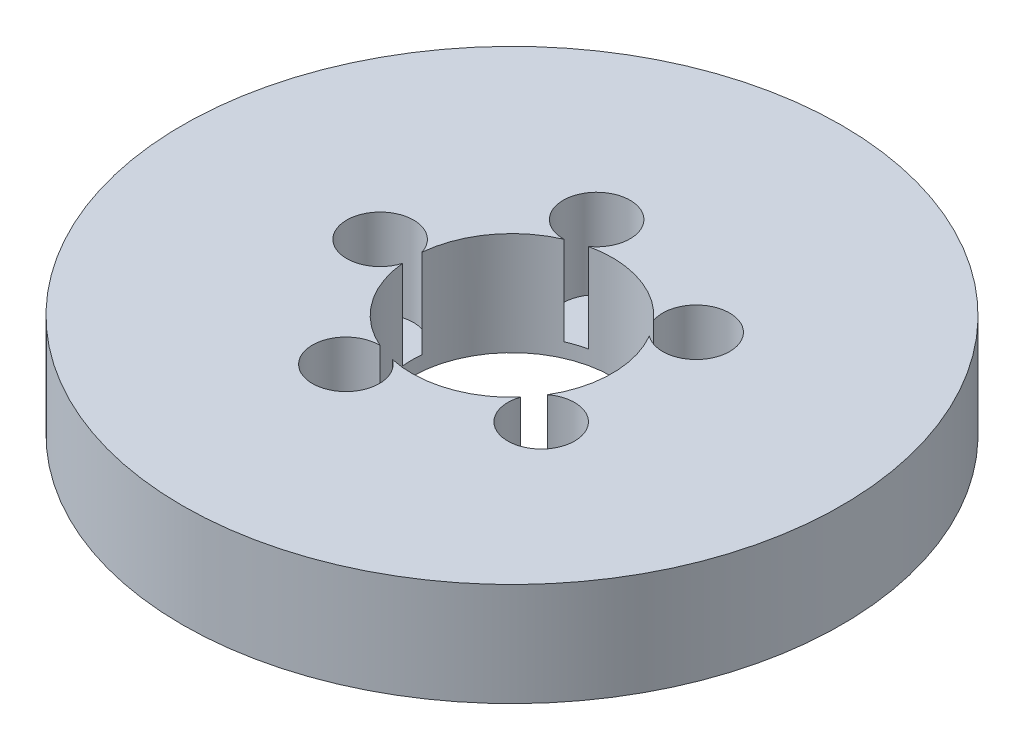
ISO-10303-21;
HEADER;
FILE_DESCRIPTION(('STEP AP214'),'2;1');
FILE_NAME('part.step','',(''),(''),'','','');
FILE_SCHEMA(('AUTOMOTIVE_DESIGN { 1 0 10303 214 1 1 1 1 }'));
ENDSEC;
DATA;
#1=APPLICATION_CONTEXT('core data for automotive mechanical design processes');
#2=APPLICATION_PROTOCOL_DEFINITION('international standard','automotive_design',2000,#1);
#3=PRODUCT_CONTEXT('',#1,'mechanical');
#4=PRODUCT('Part','Part','',(#3));
#5=PRODUCT_RELATED_PRODUCT_CATEGORY('part','',(#4));
#6=PRODUCT_DEFINITION_FORMATION('','',#4);
#7=PRODUCT_DEFINITION_CONTEXT('part definition',#1,'design');
#8=PRODUCT_DEFINITION('design','',#6,#7);
#9=PRODUCT_DEFINITION_SHAPE('','',#8);
#10=(LENGTH_UNIT() NAMED_UNIT(*) SI_UNIT(.MILLI.,.METRE.));
#11=(NAMED_UNIT(*) PLANE_ANGLE_UNIT() SI_UNIT($,.RADIAN.));
#12=(NAMED_UNIT(*) SI_UNIT($,.STERADIAN.) SOLID_ANGLE_UNIT());
#13=UNCERTAINTY_MEASURE_WITH_UNIT(LENGTH_MEASURE(1.E-05),#10,'distance_accuracy_value','');
#14=(GEOMETRIC_REPRESENTATION_CONTEXT(3) GLOBAL_UNCERTAINTY_ASSIGNED_CONTEXT((#13)) GLOBAL_UNIT_ASSIGNED_CONTEXT((#10,
#11,#12)) REPRESENTATION_CONTEXT('',''));
#15=CARTESIAN_POINT('',(0.,0.,0.));
#16=DIRECTION('',(0.,0.,1.));
#17=DIRECTION('',(1.,0.,0.));
#18=AXIS2_PLACEMENT_3D('',#15,#16,#17);
#19=CARTESIAN_POINT('',(0.,18.,0.));
#20=DIRECTION('',(0.,-1.,0.));
#21=DIRECTION('',(0.,0.,-1.));
#22=AXIS2_PLACEMENT_3D('',#19,#20,#21);
#23=CYLINDRICAL_SURFACE('',#22,57.5);
#24=CARTESIAN_POINT('',(0.,18.,0.));
#25=DIRECTION('',(0.,1.,0.));
#26=DIRECTION('',(0.,0.,1.));
#27=AXIS2_PLACEMENT_3D('',#24,#25,#26);
#28=CIRCLE('',#27,57.5);
#29=CARTESIAN_POINT('',(0.,18.,57.5));
#30=VERTEX_POINT('',#29);
#31=EDGE_CURVE('E157',#30,#30,#28,.T.);
#32=ORIENTED_EDGE('',*,*,#31,.F.);
#33=EDGE_LOOP('',(#32));
#34=FACE_BOUND('',#33,.T.);
#35=CARTESIAN_POINT('',(0.,0.,0.));
#36=DIRECTION('',(0.,1.,0.));
#37=DIRECTION('',(0.,0.,1.));
#38=AXIS2_PLACEMENT_3D('',#35,#36,#37);
#39=CIRCLE('',#38,57.5);
#40=CARTESIAN_POINT('',(0.,0.,57.5));
#41=VERTEX_POINT('',#40);
#42=EDGE_CURVE('E150',#41,#41,#39,.T.);
#43=ORIENTED_EDGE('',*,*,#42,.T.);
#44=EDGE_LOOP('',(#43));
#45=FACE_BOUND('',#44,.T.);
#46=ADVANCED_FACE('F39',(#34,#45),#23,.T.);
#47=CARTESIAN_POINT('',(0.,18.,0.));
#48=DIRECTION('',(0.,1.,0.));
#49=DIRECTION('',(0.,0.,1.));
#50=AXIS2_PLACEMENT_3D('',#47,#48,#49);
#51=PLANE('',#50);
#52=CARTESIAN_POINT('',(-7.10844494353619,18.,-21.8775439776372));
#53=DIRECTION('',(0.,1.,0.));
#54=DIRECTION('',(-0.95105651629515,0.,0.309016994374958));
#55=AXIS2_PLACEMENT_3D('',#52,#53,#54);
#56=CIRCLE('',#55,5.83549377609575);
#57=CARTESIAN_POINT('',(-3.77471490858524,18.,-17.0880521815362));
#58=VERTEX_POINT('',#57);
#59=CARTESIAN_POINT('',(-6.99029655274564,18.,-16.0432463705035));
#60=VERTEX_POINT('',#59);
#61=EDGE_CURVE('E194',#58,#60,#56,.T.);
#62=ORIENTED_EDGE('',*,*,#61,.F.);
#63=CARTESIAN_POINT('',(0.,18.,0.));
#64=DIRECTION('',(0.,1.,0.));
#65=DIRECTION('',(0.,0.,1.));
#66=AXIS2_PLACEMENT_3D('',#63,#64,#65);
#67=CIRCLE('',#66,17.5);
#68=CARTESIAN_POINT('',(13.0979135726769,18.,-11.605802860754));
#69=VERTEX_POINT('',#68);
#70=EDGE_CURVE('E147',#69,#58,#67,.T.);
#71=ORIENTED_EDGE('',*,*,#70,.F.);
#72=CARTESIAN_POINT('',(18.6101504693343,18.,-13.5210657685505));
#73=DIRECTION('',(0.,1.,0.));
#74=DIRECTION('',(-0.58778525229248,0.,-0.809016994374942));
#75=AXIS2_PLACEMENT_3D('',#72,#73,#74);
#76=CIRCLE('',#75,5.83549377609575);
#77=CARTESIAN_POINT('',(15.0852523223683,18.,-8.870465735827));
#78=VERTEX_POINT('',#77);
#79=EDGE_CURVE('E254',#78,#69,#76,.T.);
#80=ORIENTED_EDGE('',*,*,#79,.F.);
#81=CARTESIAN_POINT('',(15.0852523223685,18.,8.87046573582679));
#82=VERTEX_POINT('',#81);
#83=EDGE_CURVE('E144',#82,#78,#67,.T.);
#84=ORIENTED_EDGE('',*,*,#83,.F.);
#85=CARTESIAN_POINT('',(18.6101504693345,18.,13.5210657685503));
#86=DIRECTION('',(0.,1.,0.));
#87=DIRECTION('',(0.587785252292469,0.,-0.809016994374951));
#88=AXIS2_PLACEMENT_3D('',#85,#86,#87);
#89=CIRCLE('',#88,5.83549377609575);
#90=CARTESIAN_POINT('',(13.0979135726771,18.,11.6058028607538));
#91=VERTEX_POINT('',#90);
#92=EDGE_CURVE('E141',#91,#82,#89,.T.);
#93=ORIENTED_EDGE('',*,*,#92,.F.);
#94=CARTESIAN_POINT('',(-3.77471490858501,18.,17.0880521815363));
#95=VERTEX_POINT('',#94);
#96=EDGE_CURVE('E134',#95,#91,#67,.T.);
#97=ORIENTED_EDGE('',*,*,#96,.F.);
#98=CARTESIAN_POINT('',(-7.10844494353588,18.,21.8775439776373));
#99=DIRECTION('',(0.,1.,0.));
#100=DIRECTION('',(0.951056516295155,0.,0.309016994374945));
#101=AXIS2_PLACEMENT_3D('',#98,#99,#100);
#102=CIRCLE('',#101,5.83549377609575);
#103=CARTESIAN_POINT('',(-6.99029655274539,18.,16.0432463705036));
#104=VERTEX_POINT('',#103);
#105=EDGE_CURVE('E111',#104,#95,#102,.T.);
#106=ORIENTED_EDGE('',*,*,#105,.F.);
#107=CARTESIAN_POINT('',(-17.4181544337149,18.,1.69053131389433));
#108=VERTEX_POINT('',#107);
#109=EDGE_CURVE('E145',#108,#104,#67,.T.);
#110=ORIENTED_EDGE('',*,*,#109,.F.);
#111=CARTESIAN_POINT('',(-23.0034110515969,18.,0.));
#112=DIRECTION('',(0.,1.,0.));
#113=DIRECTION('',(0.,0.,1.));
#114=AXIS2_PLACEMENT_3D('',#111,#112,#113);
#115=CIRCLE('',#114,5.83549377609575);
#116=CARTESIAN_POINT('',(-17.4181544337149,18.,-1.69053131389433));
#117=VERTEX_POINT('',#116);
#118=EDGE_CURVE('E153',#117,#108,#115,.T.);
#119=ORIENTED_EDGE('',*,*,#118,.F.);
#120=EDGE_CURVE('E146',#60,#117,#67,.T.);
#121=ORIENTED_EDGE('',*,*,#120,.F.);
#122=EDGE_LOOP('',(#62,#71,#80,#84,#93,#97,#106,#110,#119,#121));
#123=FACE_BOUND('',#122,.T.);
#124=ORIENTED_EDGE('',*,*,#31,.T.);
#125=EDGE_LOOP('',(#124));
#126=FACE_BOUND('',#125,.T.);
#127=ADVANCED_FACE('F139',(#123,#126),#51,.T.);
#128=CARTESIAN_POINT('',(0.,0.,0.));
#129=DIRECTION('',(0.,1.,0.));
#130=DIRECTION('',(0.,0.,1.));
#131=AXIS2_PLACEMENT_3D('',#128,#129,#130);
#132=PLANE('',#131);
#133=CARTESIAN_POINT('',(0.,0.,0.));
#134=DIRECTION('',(0.,1.,0.));
#135=DIRECTION('',(0.,0.,1.));
#136=AXIS2_PLACEMENT_3D('',#133,#134,#135);
#137=CIRCLE('',#136,17.5);
#138=CARTESIAN_POINT('',(0.,0.,17.5));
#139=VERTEX_POINT('',#138);
#140=EDGE_CURVE('E154',#139,#139,#137,.T.);
#141=ORIENTED_EDGE('',*,*,#140,.T.);
#142=EDGE_LOOP('',(#141));
#143=FACE_BOUND('',#142,.T.);
#144=ORIENTED_EDGE('',*,*,#42,.F.);
#145=EDGE_LOOP('',(#144));
#146=FACE_BOUND('',#145,.T.);
#147=ADVANCED_FACE('F213',(#143,#146),#132,.F.);
#148=CARTESIAN_POINT('',(0.,18.,0.));
#149=DIRECTION('',(0.,-1.,0.));
#150=DIRECTION('',(0.,0.,-1.));
#151=AXIS2_PLACEMENT_3D('',#148,#149,#150);
#152=CYLINDRICAL_SURFACE('',#151,17.5);
#153=DIRECTION('',(0.,1.,0.));
#154=VECTOR('',#153,1.);
#155=CARTESIAN_POINT('',(-3.77471490858526,10.2531106142391,-17.0880521815362));
#156=LINE('',#155,#154);
#157=CARTESIAN_POINT('',(-3.77471490858524,2.50622122847827,-17.0880521815362));
#158=VERTEX_POINT('',#157);
#159=EDGE_CURVE('E11',#158,#58,#156,.T.);
#160=ORIENTED_EDGE('',*,*,#159,.F.);
#161=CARTESIAN_POINT('',(0.,2.50622122847827,0.));
#162=DIRECTION('',(0.,1.,0.));
#163=DIRECTION('',(0.,0.,1.));
#164=AXIS2_PLACEMENT_3D('',#161,#162,#163);
#165=CIRCLE('',#164,17.5);
#166=CARTESIAN_POINT('',(-6.99029655274564,2.50622122847827,-16.0432463705035));
#167=VERTEX_POINT('',#166);
#168=EDGE_CURVE('E189',#158,#167,#165,.T.);
#169=ORIENTED_EDGE('',*,*,#168,.T.);
#170=DIRECTION('',(0.,1.,0.));
#171=VECTOR('',#170,1.);
#172=CARTESIAN_POINT('',(-6.99029655274561,10.2531106142391,-16.0432463705035));
#173=LINE('',#172,#171);
#174=EDGE_CURVE('E46',#60,#167,#173,.F.);
#175=ORIENTED_EDGE('',*,*,#174,.F.);
#176=ORIENTED_EDGE('',*,*,#120,.T.);
#177=DIRECTION('',(0.,1.,0.));
#178=VECTOR('',#177,1.);
#179=CARTESIAN_POINT('',(-17.4181544337149,10.2531106142391,-1.6905313138943));
#180=LINE('',#179,#178);
#181=CARTESIAN_POINT('',(-17.4181544337149,2.50622122847827,-1.69053131389433));
#182=VERTEX_POINT('',#181);
#183=EDGE_CURVE('E168',#182,#117,#180,.T.);
#184=ORIENTED_EDGE('',*,*,#183,.F.);
#185=CARTESIAN_POINT('',(0.,2.50622122847827,0.));
#186=DIRECTION('',(0.,1.,0.));
#187=DIRECTION('',(0.,0.,1.));
#188=AXIS2_PLACEMENT_3D('',#185,#186,#187);
#189=CIRCLE('',#188,17.5);
#190=CARTESIAN_POINT('',(-17.4181544337149,2.50622122847827,1.69053131389433));
#191=VERTEX_POINT('',#190);
#192=EDGE_CURVE('E165',#182,#191,#189,.T.);
#193=ORIENTED_EDGE('',*,*,#192,.T.);
#194=DIRECTION('',(0.,1.,0.));
#195=VECTOR('',#194,1.);
#196=CARTESIAN_POINT('',(-17.4181544337149,10.2531106142391,1.6905313138943));
#197=LINE('',#196,#195);
#198=EDGE_CURVE('E170',#108,#191,#197,.F.);
#199=ORIENTED_EDGE('',*,*,#198,.F.);
#200=ORIENTED_EDGE('',*,*,#109,.T.);
#201=DIRECTION('',(0.,1.,0.));
#202=VECTOR('',#201,1.);
#203=CARTESIAN_POINT('',(-6.99029655274539,10.2531106142391,16.0432463705036));
#204=LINE('',#203,#202);
#205=CARTESIAN_POINT('',(-6.99029655274539,2.50622122847827,16.0432463705036));
#206=VERTEX_POINT('',#205);
#207=EDGE_CURVE('E121',#206,#104,#204,.T.);
#208=ORIENTED_EDGE('',*,*,#207,.F.);
#209=CARTESIAN_POINT('',(0.,2.50622122847827,0.));
#210=DIRECTION('',(0.,1.,0.));
#211=DIRECTION('',(0.,0.,1.));
#212=AXIS2_PLACEMENT_3D('',#209,#210,#211);
#213=CIRCLE('',#212,17.5);
#214=CARTESIAN_POINT('',(-3.77471490858501,2.50622122847827,17.0880521815363));
#215=VERTEX_POINT('',#214);
#216=EDGE_CURVE('E136',#206,#215,#213,.T.);
#217=ORIENTED_EDGE('',*,*,#216,.T.);
#218=DIRECTION('',(0.,1.,0.));
#219=VECTOR('',#218,1.);
#220=CARTESIAN_POINT('',(-3.77471490858502,10.2531106142391,17.0880521815363));
#221=LINE('',#220,#219);
#222=EDGE_CURVE('E117',#95,#215,#221,.F.);
#223=ORIENTED_EDGE('',*,*,#222,.F.);
#224=ORIENTED_EDGE('',*,*,#96,.T.);
#225=DIRECTION('',(0.,1.,0.));
#226=VECTOR('',#225,1.);
#227=CARTESIAN_POINT('',(13.0979135726771,10.2531106142391,11.6058028607538));
#228=LINE('',#227,#226);
#229=CARTESIAN_POINT('',(13.0979135726771,2.50622122847827,11.6058028607538));
#230=VERTEX_POINT('',#229);
#231=EDGE_CURVE('E182',#230,#91,#228,.T.);
#232=ORIENTED_EDGE('',*,*,#231,.F.);
#233=CARTESIAN_POINT('',(0.,2.50622122847827,0.));
#234=DIRECTION('',(0.,1.,0.));
#235=DIRECTION('',(0.,0.,1.));
#236=AXIS2_PLACEMENT_3D('',#233,#234,#235);
#237=CIRCLE('',#236,17.5);
#238=CARTESIAN_POINT('',(15.0852523223685,2.50622122847827,8.87046573582679));
#239=VERTEX_POINT('',#238);
#240=EDGE_CURVE('E174',#230,#239,#237,.T.);
#241=ORIENTED_EDGE('',*,*,#240,.T.);
#242=DIRECTION('',(0.,1.,0.));
#243=VECTOR('',#242,1.);
#244=CARTESIAN_POINT('',(15.0852523223684,10.2531106142391,8.8704657358268));
#245=LINE('',#244,#243);
#246=EDGE_CURVE('E177',#82,#239,#245,.F.);
#247=ORIENTED_EDGE('',*,*,#246,.F.);
#248=ORIENTED_EDGE('',*,*,#83,.T.);
#249=DIRECTION('',(0.,1.,0.));
#250=VECTOR('',#249,1.);
#251=CARTESIAN_POINT('',(15.0852523223683,10.2531106142391,-8.87046573582701));
#252=LINE('',#251,#250);
#253=CARTESIAN_POINT('',(15.0852523223683,2.50622122847827,-8.870465735827));
#254=VERTEX_POINT('',#253);
#255=EDGE_CURVE('E187',#254,#78,#252,.T.);
#256=ORIENTED_EDGE('',*,*,#255,.F.);
#257=CARTESIAN_POINT('',(0.,2.50622122847827,0.));
#258=DIRECTION('',(0.,1.,0.));
#259=DIRECTION('',(0.,0.,1.));
#260=AXIS2_PLACEMENT_3D('',#257,#258,#259);
#261=CIRCLE('',#260,17.5);
#262=CARTESIAN_POINT('',(13.0979135726769,2.50622122847827,-11.605802860754));
#263=VERTEX_POINT('',#262);
#264=EDGE_CURVE('E181',#254,#263,#261,.T.);
#265=ORIENTED_EDGE('',*,*,#264,.T.);
#266=DIRECTION('',(0.,1.,0.));
#267=VECTOR('',#266,1.);
#268=CARTESIAN_POINT('',(13.0979135726769,10.2531106142391,-11.605802860754));
#269=LINE('',#268,#267);
#270=EDGE_CURVE('E186',#69,#263,#269,.F.);
#271=ORIENTED_EDGE('',*,*,#270,.F.);
#272=ORIENTED_EDGE('',*,*,#70,.T.);
#273=EDGE_LOOP('',(#160,#169,#175,#176,#184,#193,#199,#200,#208,#217,#223,#224,#232,#241,#247,
#248,#256,#265,#271,#272));
#274=FACE_BOUND('',#273,.T.);
#275=ORIENTED_EDGE('',*,*,#140,.F.);
#276=EDGE_LOOP('',(#275));
#277=FACE_BOUND('',#276,.T.);
#278=ADVANCED_FACE('F135',(#274,#277),#152,.F.);
#279=CARTESIAN_POINT('',(-23.0034110515969,2.50622122847827,0.));
#280=DIRECTION('',(0.,1.,0.));
#281=DIRECTION('',(0.,0.,1.));
#282=AXIS2_PLACEMENT_3D('',#279,#280,#281);
#283=CYLINDRICAL_SURFACE('',#282,5.83549377609575);
#284=ORIENTED_EDGE('',*,*,#183,.T.);
#285=ORIENTED_EDGE('',*,*,#118,.T.);
#286=ORIENTED_EDGE('',*,*,#198,.T.);
#287=CARTESIAN_POINT('',(-23.0034110515969,2.50622122847827,0.));
#288=DIRECTION('',(0.,1.,0.));
#289=DIRECTION('',(0.,0.,1.));
#290=AXIS2_PLACEMENT_3D('',#287,#288,#289);
#291=CIRCLE('',#290,5.83549377609575);
#292=EDGE_CURVE('E158',#182,#191,#291,.T.);
#293=ORIENTED_EDGE('',*,*,#292,.F.);
#294=EDGE_LOOP('',(#284,#285,#286,#293));
#295=FACE_BOUND('',#294,.T.);
#296=ADVANCED_FACE('F221',(#295),#283,.F.);
#297=CARTESIAN_POINT('',(-23.0034110515969,2.50622122847827,0.));
#298=DIRECTION('',(0.,1.,0.));
#299=DIRECTION('',(0.,0.,1.));
#300=AXIS2_PLACEMENT_3D('',#297,#298,#299);
#301=PLANE('',#300);
#302=ORIENTED_EDGE('',*,*,#292,.T.);
#303=ORIENTED_EDGE('',*,*,#192,.F.);
#304=EDGE_LOOP('',(#302,#303));
#305=FACE_BOUND('',#304,.T.);
#306=ADVANCED_FACE('F227',(#305),#301,.T.);
#307=CARTESIAN_POINT('',(-7.10844494353588,2.50622122847827,21.8775439776373));
#308=DIRECTION('',(0.,1.,0.));
#309=DIRECTION('',(0.,0.,1.));
#310=AXIS2_PLACEMENT_3D('',#307,#308,#309);
#311=CYLINDRICAL_SURFACE('',#310,5.83549377609575);
#312=ORIENTED_EDGE('',*,*,#207,.T.);
#313=ORIENTED_EDGE('',*,*,#105,.T.);
#314=ORIENTED_EDGE('',*,*,#222,.T.);
#315=CARTESIAN_POINT('',(-7.10844494353588,2.50622122847827,21.8775439776373));
#316=DIRECTION('',(0.,1.,0.));
#317=DIRECTION('',(0.951056516295155,0.,0.309016994374945));
#318=AXIS2_PLACEMENT_3D('',#315,#316,#317);
#319=CIRCLE('',#318,5.83549377609575);
#320=EDGE_CURVE('E127',#206,#215,#319,.T.);
#321=ORIENTED_EDGE('',*,*,#320,.F.);
#322=EDGE_LOOP('',(#312,#313,#314,#321));
#323=FACE_BOUND('',#322,.T.);
#324=ADVANCED_FACE('F116',(#323),#311,.F.);
#325=CARTESIAN_POINT('',(-7.10844494353588,2.50622122847827,21.8775439776373));
#326=DIRECTION('',(0.,1.,0.));
#327=DIRECTION('',(0.951056516295155,0.,0.309016994374945));
#328=AXIS2_PLACEMENT_3D('',#325,#326,#327);
#329=PLANE('',#328);
#330=ORIENTED_EDGE('',*,*,#320,.T.);
#331=ORIENTED_EDGE('',*,*,#216,.F.);
#332=EDGE_LOOP('',(#330,#331));
#333=FACE_BOUND('',#332,.T.);
#334=ADVANCED_FACE('F234',(#333),#329,.T.);
#335=CARTESIAN_POINT('',(18.6101504693345,2.50622122847827,13.5210657685503));
#336=DIRECTION('',(0.,1.,0.));
#337=DIRECTION('',(0.,0.,1.));
#338=AXIS2_PLACEMENT_3D('',#335,#336,#337);
#339=CYLINDRICAL_SURFACE('',#338,5.83549377609575);
#340=ORIENTED_EDGE('',*,*,#231,.T.);
#341=ORIENTED_EDGE('',*,*,#92,.T.);
#342=ORIENTED_EDGE('',*,*,#246,.T.);
#343=CARTESIAN_POINT('',(18.6101504693345,2.50622122847827,13.5210657685503));
#344=DIRECTION('',(0.,1.,0.));
#345=DIRECTION('',(0.587785252292469,0.,-0.809016994374951));
#346=AXIS2_PLACEMENT_3D('',#343,#344,#345);
#347=CIRCLE('',#346,5.83549377609575);
#348=EDGE_CURVE('E130',#230,#239,#347,.T.);
#349=ORIENTED_EDGE('',*,*,#348,.F.);
#350=EDGE_LOOP('',(#340,#341,#342,#349));
#351=FACE_BOUND('',#350,.T.);
#352=ADVANCED_FACE('F240',(#351),#339,.F.);
#353=CARTESIAN_POINT('',(18.6101504693345,2.50622122847827,13.5210657685503));
#354=DIRECTION('',(0.,1.,0.));
#355=DIRECTION('',(0.587785252292469,0.,-0.809016994374951));
#356=AXIS2_PLACEMENT_3D('',#353,#354,#355);
#357=PLANE('',#356);
#358=ORIENTED_EDGE('',*,*,#348,.T.);
#359=ORIENTED_EDGE('',*,*,#240,.F.);
#360=EDGE_LOOP('',(#358,#359));
#361=FACE_BOUND('',#360,.T.);
#362=ADVANCED_FACE('F245',(#361),#357,.T.);
#363=CARTESIAN_POINT('',(18.6101504693343,2.50622122847827,-13.5210657685505));
#364=DIRECTION('',(0.,1.,0.));
#365=DIRECTION('',(0.,0.,1.));
#366=AXIS2_PLACEMENT_3D('',#363,#364,#365);
#367=CYLINDRICAL_SURFACE('',#366,5.83549377609575);
#368=ORIENTED_EDGE('',*,*,#255,.T.);
#369=ORIENTED_EDGE('',*,*,#79,.T.);
#370=ORIENTED_EDGE('',*,*,#270,.T.);
#371=CARTESIAN_POINT('',(18.6101504693343,2.50622122847827,-13.5210657685505));
#372=DIRECTION('',(0.,1.,0.));
#373=DIRECTION('',(-0.58778525229248,0.,-0.809016994374942));
#374=AXIS2_PLACEMENT_3D('',#371,#372,#373);
#375=CIRCLE('',#374,5.83549377609575);
#376=EDGE_CURVE('E56',#254,#263,#375,.T.);
#377=ORIENTED_EDGE('',*,*,#376,.F.);
#378=EDGE_LOOP('',(#368,#369,#370,#377));
#379=FACE_BOUND('',#378,.T.);
#380=ADVANCED_FACE('F266',(#379),#367,.F.);
#381=CARTESIAN_POINT('',(18.6101504693343,2.50622122847827,-13.5210657685505));
#382=DIRECTION('',(0.,1.,0.));
#383=DIRECTION('',(-0.58778525229248,0.,-0.809016994374942));
#384=AXIS2_PLACEMENT_3D('',#381,#382,#383);
#385=PLANE('',#384);
#386=ORIENTED_EDGE('',*,*,#376,.T.);
#387=ORIENTED_EDGE('',*,*,#264,.F.);
#388=EDGE_LOOP('',(#386,#387));
#389=FACE_BOUND('',#388,.T.);
#390=ADVANCED_FACE('F204',(#389),#385,.T.);
#391=CARTESIAN_POINT('',(-7.10844494353619,2.50622122847827,-21.8775439776372));
#392=DIRECTION('',(0.,1.,0.));
#393=DIRECTION('',(0.,0.,1.));
#394=AXIS2_PLACEMENT_3D('',#391,#392,#393);
#395=CYLINDRICAL_SURFACE('',#394,5.83549377609575);
#396=ORIENTED_EDGE('',*,*,#159,.T.);
#397=ORIENTED_EDGE('',*,*,#61,.T.);
#398=ORIENTED_EDGE('',*,*,#174,.T.);
#399=CARTESIAN_POINT('',(-7.10844494353619,2.50622122847827,-21.8775439776372));
#400=DIRECTION('',(0.,1.,0.));
#401=DIRECTION('',(-0.95105651629515,0.,0.309016994374958));
#402=AXIS2_PLACEMENT_3D('',#399,#400,#401);
#403=CIRCLE('',#402,5.83549377609575);
#404=EDGE_CURVE('E55',#158,#167,#403,.T.);
#405=ORIENTED_EDGE('',*,*,#404,.F.);
#406=EDGE_LOOP('',(#396,#397,#398,#405));
#407=FACE_BOUND('',#406,.T.);
#408=ADVANCED_FACE('F193',(#407),#395,.F.);
#409=CARTESIAN_POINT('',(-7.10844494353619,2.50622122847827,-21.8775439776372));
#410=DIRECTION('',(0.,1.,0.));
#411=DIRECTION('',(-0.95105651629515,0.,0.309016994374958));
#412=AXIS2_PLACEMENT_3D('',#409,#410,#411);
#413=PLANE('',#412);
#414=ORIENTED_EDGE('',*,*,#404,.T.);
#415=ORIENTED_EDGE('',*,*,#168,.F.);
#416=EDGE_LOOP('',(#414,#415));
#417=FACE_BOUND('',#416,.T.);
#418=ADVANCED_FACE('F196',(#417),#413,.T.);
#419=CLOSED_SHELL('',(#46,#127,#147,#278,#296,#306,#324,#334,#352,#362,#380,#390,#408,#418));
#420=MANIFOLD_SOLID_BREP('B2',#419);
#421=ADVANCED_BREP_SHAPE_REPRESENTATION('',(#18,#420),#14);
#422=SHAPE_DEFINITION_REPRESENTATION(#9,#421);
ENDSEC;
END-ISO-10303-21;
